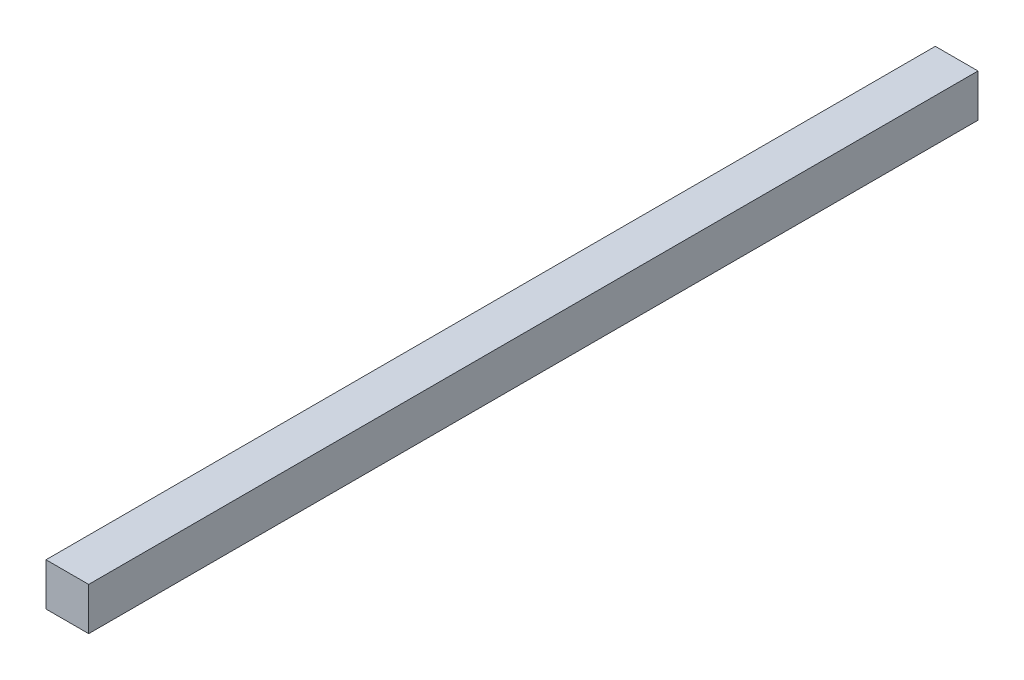
ISO-10303-21;
HEADER;
FILE_DESCRIPTION(('STEP AP214'),'2;1');
FILE_NAME('part.step','',(''),(''),'','','');
FILE_SCHEMA(('AUTOMOTIVE_DESIGN { 1 0 10303 214 1 1 1 1 }'));
ENDSEC;
DATA;
#1=APPLICATION_CONTEXT('core data for automotive mechanical design processes');
#2=APPLICATION_PROTOCOL_DEFINITION('international standard','automotive_design',2000,#1);
#3=PRODUCT_CONTEXT('',#1,'mechanical');
#4=PRODUCT('Part','Part','',(#3));
#5=PRODUCT_RELATED_PRODUCT_CATEGORY('part','',(#4));
#6=PRODUCT_DEFINITION_FORMATION('','',#4);
#7=PRODUCT_DEFINITION_CONTEXT('part definition',#1,'design');
#8=PRODUCT_DEFINITION('design','',#6,#7);
#9=PRODUCT_DEFINITION_SHAPE('','',#8);
#10=(LENGTH_UNIT() NAMED_UNIT(*) SI_UNIT(.MILLI.,.METRE.));
#11=(NAMED_UNIT(*) PLANE_ANGLE_UNIT() SI_UNIT($,.RADIAN.));
#12=(NAMED_UNIT(*) SI_UNIT($,.STERADIAN.) SOLID_ANGLE_UNIT());
#13=UNCERTAINTY_MEASURE_WITH_UNIT(LENGTH_MEASURE(1.E-05),#10,'distance_accuracy_value','');
#14=(GEOMETRIC_REPRESENTATION_CONTEXT(3) GLOBAL_UNCERTAINTY_ASSIGNED_CONTEXT((#13)) GLOBAL_UNIT_ASSIGNED_CONTEXT((#10,
#11,#12)) REPRESENTATION_CONTEXT('',''));
#15=CARTESIAN_POINT('',(0.,0.,0.));
#16=DIRECTION('',(0.,0.,1.));
#17=DIRECTION('',(1.,0.,0.));
#18=AXIS2_PLACEMENT_3D('',#15,#16,#17);
#19=CARTESIAN_POINT('',(-0.3048,-0.3048,0.));
#20=DIRECTION('',(-1.,0.,0.));
#21=DIRECTION('',(0.,0.,1.));
#22=AXIS2_PLACEMENT_3D('',#19,#20,#21);
#23=PLANE('',#22);
#24=DIRECTION('',(0.,0.,1.));
#25=VECTOR('',#24,1.);
#26=CARTESIAN_POINT('',(-0.3048,0.3048,0.));
#27=LINE('',#26,#25);
#28=CARTESIAN_POINT('',(-0.3048,0.3048,0.));
#29=VERTEX_POINT('',#28);
#30=CARTESIAN_POINT('',(-0.3048,0.3048,12.7));
#31=VERTEX_POINT('',#30);
#32=EDGE_CURVE('E62',#29,#31,#27,.T.);
#33=ORIENTED_EDGE('',*,*,#32,.F.);
#34=DIRECTION('',(0.,1.,0.));
#35=VECTOR('',#34,1.);
#36=CARTESIAN_POINT('',(-0.3048,-0.3048,0.));
#37=LINE('',#36,#35);
#38=CARTESIAN_POINT('',(-0.3048,-0.3048,0.));
#39=VERTEX_POINT('',#38);
#40=EDGE_CURVE('E20',#29,#39,#37,.F.);
#41=ORIENTED_EDGE('',*,*,#40,.T.);
#42=DIRECTION('',(0.,0.,-1.));
#43=VECTOR('',#42,1.);
#44=CARTESIAN_POINT('',(-0.3048,-0.3048,0.));
#45=LINE('',#44,#43);
#46=CARTESIAN_POINT('',(-0.3048,-0.3048,12.7));
#47=VERTEX_POINT('',#46);
#48=EDGE_CURVE('E69',#47,#39,#45,.T.);
#49=ORIENTED_EDGE('',*,*,#48,.F.);
#50=DIRECTION('',(0.,1.,0.));
#51=VECTOR('',#50,1.);
#52=CARTESIAN_POINT('',(-0.3048,0.3048,12.7));
#53=LINE('',#52,#51);
#54=EDGE_CURVE('E56',#31,#47,#53,.F.);
#55=ORIENTED_EDGE('',*,*,#54,.F.);
#56=EDGE_LOOP('',(#33,#41,#49,#55));
#57=FACE_BOUND('',#56,.T.);
#58=ADVANCED_FACE('F17',(#57),#23,.T.);
#59=CARTESIAN_POINT('',(-0.3048,0.3048,0.));
#60=DIRECTION('',(0.,1.,0.));
#61=DIRECTION('',(0.,0.,1.));
#62=AXIS2_PLACEMENT_3D('',#59,#60,#61);
#63=PLANE('',#62);
#64=DIRECTION('',(0.,0.,-1.));
#65=VECTOR('',#64,1.);
#66=CARTESIAN_POINT('',(0.3048,0.3048,0.));
#67=LINE('',#66,#65);
#68=CARTESIAN_POINT('',(0.3048,0.3048,0.));
#69=VERTEX_POINT('',#68);
#70=CARTESIAN_POINT('',(0.3048,0.3048,12.7));
#71=VERTEX_POINT('',#70);
#72=EDGE_CURVE('E83',#69,#71,#67,.F.);
#73=ORIENTED_EDGE('',*,*,#72,.F.);
#74=DIRECTION('',(1.,0.,0.));
#75=VECTOR('',#74,1.);
#76=CARTESIAN_POINT('',(0.3048,0.3048,0.));
#77=LINE('',#76,#75);
#78=EDGE_CURVE('E67',#69,#29,#77,.F.);
#79=ORIENTED_EDGE('',*,*,#78,.T.);
#80=ORIENTED_EDGE('',*,*,#32,.T.);
#81=DIRECTION('',(1.,0.,0.));
#82=VECTOR('',#81,1.);
#83=CARTESIAN_POINT('',(0.3048,0.3048,12.7));
#84=LINE('',#83,#82);
#85=EDGE_CURVE('E64',#71,#31,#84,.F.);
#86=ORIENTED_EDGE('',*,*,#85,.F.);
#87=EDGE_LOOP('',(#73,#79,#80,#86));
#88=FACE_BOUND('',#87,.T.);
#89=ADVANCED_FACE('F63',(#88),#63,.T.);
#90=CARTESIAN_POINT('',(0.3048,0.3048,12.7));
#91=DIRECTION('',(0.,0.,1.));
#92=DIRECTION('',(1.,0.,0.));
#93=AXIS2_PLACEMENT_3D('',#90,#91,#92);
#94=PLANE('',#93);
#95=DIRECTION('',(1.,0.,0.));
#96=VECTOR('',#95,1.);
#97=CARTESIAN_POINT('',(0.3048,-0.3048,12.7));
#98=LINE('',#97,#96);
#99=CARTESIAN_POINT('',(0.3048,-0.3048,12.7));
#100=VERTEX_POINT('',#99);
#101=EDGE_CURVE('E71',#100,#47,#98,.F.);
#102=ORIENTED_EDGE('',*,*,#101,.F.);
#103=DIRECTION('',(0.,1.,0.));
#104=VECTOR('',#103,1.);
#105=CARTESIAN_POINT('',(0.3048,0.3048,12.7));
#106=LINE('',#105,#104);
#107=EDGE_CURVE('E75',#71,#100,#106,.F.);
#108=ORIENTED_EDGE('',*,*,#107,.F.);
#109=ORIENTED_EDGE('',*,*,#85,.T.);
#110=ORIENTED_EDGE('',*,*,#54,.T.);
#111=EDGE_LOOP('',(#102,#108,#109,#110));
#112=FACE_BOUND('',#111,.T.);
#113=ADVANCED_FACE('F73',(#112),#94,.T.);
#114=CARTESIAN_POINT('',(0.3048,-0.3048,0.));
#115=DIRECTION('',(0.,-1.,0.));
#116=DIRECTION('',(0.,0.,-1.));
#117=AXIS2_PLACEMENT_3D('',#114,#115,#116);
#118=PLANE('',#117);
#119=ORIENTED_EDGE('',*,*,#48,.T.);
#120=DIRECTION('',(1.,0.,0.));
#121=VECTOR('',#120,1.);
#122=CARTESIAN_POINT('',(0.3048,-0.3048,0.));
#123=LINE('',#122,#121);
#124=CARTESIAN_POINT('',(0.3048,-0.3048,0.));
#125=VERTEX_POINT('',#124);
#126=EDGE_CURVE('E35',#39,#125,#123,.T.);
#127=ORIENTED_EDGE('',*,*,#126,.T.);
#128=DIRECTION('',(0.,0.,-1.));
#129=VECTOR('',#128,1.);
#130=CARTESIAN_POINT('',(0.3048,-0.3048,0.));
#131=LINE('',#130,#129);
#132=EDGE_CURVE('E26',#100,#125,#131,.T.);
#133=ORIENTED_EDGE('',*,*,#132,.F.);
#134=ORIENTED_EDGE('',*,*,#101,.T.);
#135=EDGE_LOOP('',(#119,#127,#133,#134));
#136=FACE_BOUND('',#135,.T.);
#137=ADVANCED_FACE('F89',(#136),#118,.T.);
#138=CARTESIAN_POINT('',(0.3048,0.3048,0.));
#139=DIRECTION('',(0.,0.,1.));
#140=DIRECTION('',(1.,0.,0.));
#141=AXIS2_PLACEMENT_3D('',#138,#139,#140);
#142=PLANE('',#141);
#143=ORIENTED_EDGE('',*,*,#126,.F.);
#144=ORIENTED_EDGE('',*,*,#40,.F.);
#145=ORIENTED_EDGE('',*,*,#78,.F.);
#146=DIRECTION('',(0.,1.,0.));
#147=VECTOR('',#146,1.);
#148=CARTESIAN_POINT('',(0.3048,0.3048,0.));
#149=LINE('',#148,#147);
#150=EDGE_CURVE('E11',#125,#69,#149,.T.);
#151=ORIENTED_EDGE('',*,*,#150,.F.);
#152=EDGE_LOOP('',(#143,#144,#145,#151));
#153=FACE_BOUND('',#152,.T.);
#154=ADVANCED_FACE('F91',(#153),#142,.F.);
#155=CARTESIAN_POINT('',(0.3048,0.3048,0.));
#156=DIRECTION('',(1.,0.,0.));
#157=DIRECTION('',(0.,0.,-1.));
#158=AXIS2_PLACEMENT_3D('',#155,#156,#157);
#159=PLANE('',#158);
#160=ORIENTED_EDGE('',*,*,#132,.T.);
#161=ORIENTED_EDGE('',*,*,#150,.T.);
#162=ORIENTED_EDGE('',*,*,#72,.T.);
#163=ORIENTED_EDGE('',*,*,#107,.T.);
#164=EDGE_LOOP('',(#160,#161,#162,#163));
#165=FACE_BOUND('',#164,.T.);
#166=ADVANCED_FACE('F88',(#165),#159,.T.);
#167=CLOSED_SHELL('',(#58,#89,#113,#137,#154,#166));
#168=MANIFOLD_SOLID_BREP('B1',#167);
#169=ADVANCED_BREP_SHAPE_REPRESENTATION('',(#18,#168),#14);
#170=SHAPE_DEFINITION_REPRESENTATION(#9,#169);
ENDSEC;
END-ISO-10303-21;
